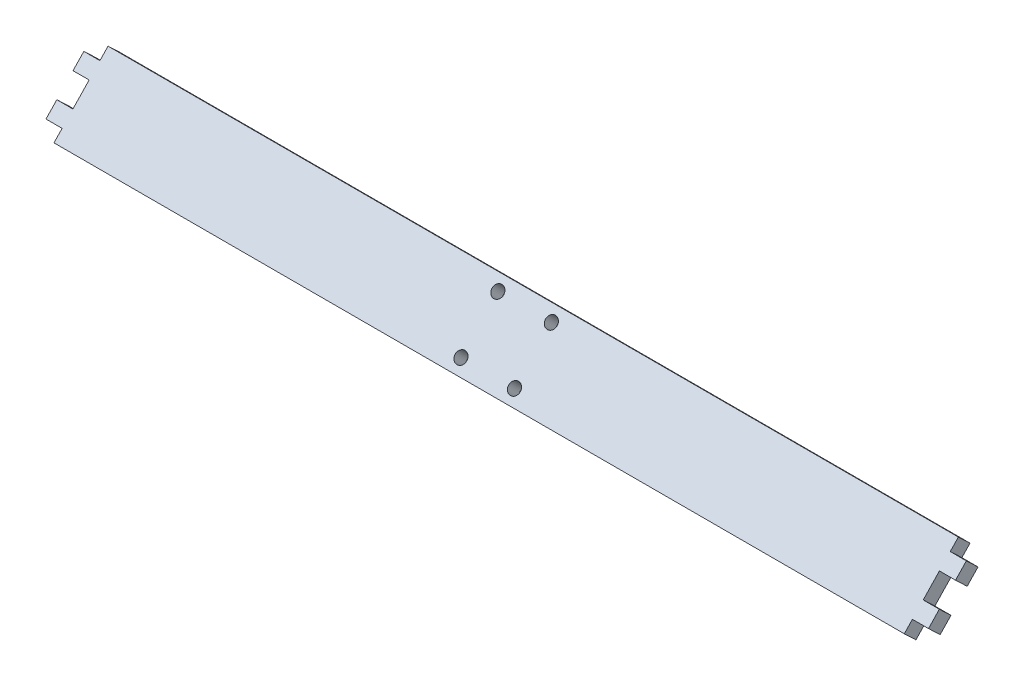
ISO-10303-21;
HEADER;
FILE_DESCRIPTION(('STEP AP214'),'2;1');
FILE_NAME('part.step','',(''),(''),'','','');
FILE_SCHEMA(('AUTOMOTIVE_DESIGN { 1 0 10303 214 1 1 1 1 }'));
ENDSEC;
DATA;
#1=APPLICATION_CONTEXT('core data for automotive mechanical design processes');
#2=APPLICATION_PROTOCOL_DEFINITION('international standard','automotive_design',2000,#1);
#3=PRODUCT_CONTEXT('',#1,'mechanical');
#4=PRODUCT('Part','Part','',(#3));
#5=PRODUCT_RELATED_PRODUCT_CATEGORY('part','',(#4));
#6=PRODUCT_DEFINITION_FORMATION('','',#4);
#7=PRODUCT_DEFINITION_CONTEXT('part definition',#1,'design');
#8=PRODUCT_DEFINITION('design','',#6,#7);
#9=PRODUCT_DEFINITION_SHAPE('','',#8);
#10=(LENGTH_UNIT() NAMED_UNIT(*) SI_UNIT(.MILLI.,.METRE.));
#11=(NAMED_UNIT(*) PLANE_ANGLE_UNIT() SI_UNIT($,.RADIAN.));
#12=(NAMED_UNIT(*) SI_UNIT($,.STERADIAN.) SOLID_ANGLE_UNIT());
#13=UNCERTAINTY_MEASURE_WITH_UNIT(LENGTH_MEASURE(1.E-05),#10,'distance_accuracy_value','');
#14=(GEOMETRIC_REPRESENTATION_CONTEXT(3) GLOBAL_UNCERTAINTY_ASSIGNED_CONTEXT((#13)) GLOBAL_UNIT_ASSIGNED_CONTEXT((#10,
#11,#12)) REPRESENTATION_CONTEXT('',''));
#15=CARTESIAN_POINT('',(0.,0.,0.));
#16=DIRECTION('',(0.,0.,1.));
#17=DIRECTION('',(1.,0.,0.));
#18=AXIS2_PLACEMENT_3D('',#15,#16,#17);
#19=CARTESIAN_POINT('',(-112.61,-13.8103448544922,-20.6734883306936));
#20=DIRECTION('',(-1.,0.,0.));
#21=DIRECTION('',(0.,0.,1.));
#22=AXIS2_PLACEMENT_3D('',#19,#20,#21);
#23=PLANE('',#22);
#24=DIRECTION('',(0.,0.689700373188127,0.724094879987532));
#25=VECTOR('',#24,1.);
#26=CARTESIAN_POINT('',(-112.61,-12.2477607566808,-37.8817447223245));
#27=LINE('',#26,#25);
#28=CARTESIAN_POINT('',(-112.61,-7.23177994845748,-32.615623138888));
#29=VERTEX_POINT('',#28);
#30=CARTESIAN_POINT('',(-112.61,-4.39711141465429,-29.6395931821392));
#31=VERTEX_POINT('',#30);
#32=EDGE_CURVE('E171',#29,#31,#27,.T.);
#33=ORIENTED_EDGE('',*,*,#32,.T.);
#34=DIRECTION('',(0.,0.724094879987532,-0.689700373188127));
#35=VECTOR('',#34,1.);
#36=CARTESIAN_POINT('',(-112.61,-13.8103448544922,-20.6734883306936));
#37=LINE('',#36,#35);
#38=CARTESIAN_POINT('',(-112.61,-1.50073189470416,-32.3983946748917));
#39=VERTEX_POINT('',#38);
#40=EDGE_CURVE('E220',#31,#39,#37,.T.);
#41=ORIENTED_EDGE('',*,*,#40,.T.);
#42=DIRECTION('',(0.,0.689700373188127,0.724094879987532));
#43=VECTOR('',#42,1.);
#44=CARTESIAN_POINT('',(-112.61,-9.35138123673063,-40.640546215077));
#45=LINE('',#44,#43);
#46=CARTESIAN_POINT('',(-112.61,-4.33540042850735,-35.3744246316405));
#47=VERTEX_POINT('',#46);
#48=EDGE_CURVE('E195',#47,#39,#45,.T.);
#49=ORIENTED_EDGE('',*,*,#48,.F.);
#50=DIRECTION('',(0.,0.724094879987532,-0.689700373188127));
#51=VECTOR('',#50,1.);
#52=CARTESIAN_POINT('',(-112.61,-16.6450133882954,-23.6495182874423));
#53=LINE('',#52,#51);
#54=EDGE_CURVE('E187',#29,#47,#53,.T.);
#55=ORIENTED_EDGE('',*,*,#54,.F.);
#56=EDGE_LOOP('',(#33,#41,#49,#55));
#57=FACE_BOUND('',#56,.T.);
#58=ADVANCED_FACE('F33',(#57),#23,.T.);
#59=CARTESIAN_POINT('',(112.61,-13.8103448544922,-20.6734883306936));
#60=DIRECTION('',(-1.,0.,0.));
#61=DIRECTION('',(0.,0.,1.));
#62=AXIS2_PLACEMENT_3D('',#59,#60,#61);
#63=PLANE('',#62);
#64=DIRECTION('',(0.,0.724094879987532,-0.689700373188127));
#65=VECTOR('',#64,1.);
#66=CARTESIAN_POINT('',(112.61,-13.8103448544922,-20.6734883306936));
#67=LINE('',#66,#65);
#68=CARTESIAN_POINT('',(112.61,-4.39711141465429,-29.6395931821392));
#69=VERTEX_POINT('',#68);
#70=CARTESIAN_POINT('',(112.61,-1.50073189470416,-32.3983946748917));
#71=VERTEX_POINT('',#70);
#72=EDGE_CURVE('E232',#69,#71,#67,.T.);
#73=ORIENTED_EDGE('',*,*,#72,.F.);
#74=DIRECTION('',(0.,0.689700373188127,0.724094879987532));
#75=VECTOR('',#74,1.);
#76=CARTESIAN_POINT('',(112.61,-12.2477607566808,-37.8817447223245));
#77=LINE('',#76,#75);
#78=CARTESIAN_POINT('',(112.61,-7.23177994845748,-32.615623138888));
#79=VERTEX_POINT('',#78);
#80=EDGE_CURVE('E262',#79,#69,#77,.T.);
#81=ORIENTED_EDGE('',*,*,#80,.F.);
#82=DIRECTION('',(0.,0.724094879987532,-0.689700373188127));
#83=VECTOR('',#82,1.);
#84=CARTESIAN_POINT('',(112.61,-16.6450133882954,-23.6495182874423));
#85=LINE('',#84,#83);
#86=CARTESIAN_POINT('',(112.61,-4.33540042850734,-35.3744246316405));
#87=VERTEX_POINT('',#86);
#88=EDGE_CURVE('E207',#79,#87,#85,.T.);
#89=ORIENTED_EDGE('',*,*,#88,.T.);
#90=DIRECTION('',(0.,0.689700373188127,0.724094879987532));
#91=VECTOR('',#90,1.);
#92=CARTESIAN_POINT('',(112.61,-9.35138123673063,-40.640546215077));
#93=LINE('',#92,#91);
#94=EDGE_CURVE('E273',#87,#71,#93,.T.);
#95=ORIENTED_EDGE('',*,*,#94,.T.);
#96=EDGE_LOOP('',(#73,#81,#89,#95));
#97=FACE_BOUND('',#96,.T.);
#98=ADVANCED_FACE('F341',(#97),#63,.F.);
#99=DIRECTION('',(0.,0.689700373188127,0.724094879987532));
#100=VECTOR('',#99,1.);
#101=CARTESIAN_POINT('',(-112.61,-16.592330036606,-33.7435424831957));
#102=LINE('',#101,#100);
#103=CARTESIAN_POINT('',(-112.61,-11.5763492283827,-28.4774208997592));
#104=VERTEX_POINT('',#103);
#105=CARTESIAN_POINT('',(-112.61,-8.74168069457949,-25.5013909430105));
#106=VERTEX_POINT('',#105);
#107=EDGE_CURVE('E181',#104,#106,#102,.T.);
#108=ORIENTED_EDGE('',*,*,#107,.F.);
#109=CARTESIAN_POINT('',(-112.61,-14.4727287483328,-25.7186194070067));
#110=VERTEX_POINT('',#109);
#111=EDGE_CURVE('E196',#110,#104,#53,.T.);
#112=ORIENTED_EDGE('',*,*,#111,.F.);
#113=DIRECTION('',(0.,0.689700373188127,0.724094879987532));
#114=VECTOR('',#113,1.);
#115=CARTESIAN_POINT('',(-112.61,-19.4887095565561,-30.9847409904432));
#116=LINE('',#115,#114);
#117=CARTESIAN_POINT('',(-112.61,-11.6380602145296,-22.742589450258));
#118=VERTEX_POINT('',#117);
#119=EDGE_CURVE('E367',#110,#118,#116,.T.);
#120=ORIENTED_EDGE('',*,*,#119,.T.);
#121=EDGE_CURVE('E225',#118,#106,#37,.T.);
#122=ORIENTED_EDGE('',*,*,#121,.T.);
#123=EDGE_LOOP('',(#108,#112,#120,#122));
#124=FACE_BOUND('',#123,.T.);
#125=ADVANCED_FACE('F35',(#124),#23,.T.);
#126=CARTESIAN_POINT('',(-112.61,-13.8103448544922,-20.6734883306936));
#127=DIRECTION('',(0.,0.724094879987532,-0.689700373188127));
#128=DIRECTION('',(0.,0.689700373188127,0.724094879987532));
#129=AXIS2_PLACEMENT_3D('',#126,#127,#128);
#130=PLANE('',#129);
#131=DIRECTION('',(1.,0.,0.));
#132=VECTOR('',#131,1.);
#133=CARTESIAN_POINT('',(-112.61,-13.8103448544922,-20.6734883306936));
#134=LINE('',#133,#132);
#135=CARTESIAN_POINT('',(-108.5,-13.8103448544922,-20.6734883306936));
#136=VERTEX_POINT('',#135);
#137=CARTESIAN_POINT('',(108.5,-13.8103448544922,-20.6734883306936));
#138=VERTEX_POINT('',#137);
#139=EDGE_CURVE('E11',#136,#138,#134,.T.);
#140=ORIENTED_EDGE('',*,*,#139,.F.);
#141=DIRECTION('',(0.,0.689700373188127,0.724094879987532));
#142=VECTOR('',#141,1.);
#143=CARTESIAN_POINT('',(-108.5,-21.6609941965187,-28.9156398708788));
#144=LINE('',#143,#142);
#145=CARTESIAN_POINT('',(-108.5,-16.6450133882954,-23.6495182874423));
#146=VERTEX_POINT('',#145);
#147=EDGE_CURVE('E370',#146,#136,#144,.T.);
#148=ORIENTED_EDGE('',*,*,#147,.F.);
#149=DIRECTION('',(1.,0.,0.));
#150=VECTOR('',#149,1.);
#151=CARTESIAN_POINT('',(-112.61,-16.6450133882954,-23.6495182874423));
#152=LINE('',#151,#150);
#153=CARTESIAN_POINT('',(108.5,-16.6450133882954,-23.6495182874423));
#154=VERTEX_POINT('',#153);
#155=EDGE_CURVE('E37',#146,#154,#152,.T.);
#156=ORIENTED_EDGE('',*,*,#155,.T.);
#157=DIRECTION('',(0.,0.689700373188127,0.724094879987532));
#158=VECTOR('',#157,1.);
#159=CARTESIAN_POINT('',(108.5,-21.6609941965187,-28.9156398708788));
#160=LINE('',#159,#158);
#161=EDGE_CURVE('E384',#154,#138,#160,.T.);
#162=ORIENTED_EDGE('',*,*,#161,.T.);
#163=EDGE_LOOP('',(#140,#148,#156,#162));
#164=FACE_BOUND('',#163,.T.);
#165=ADVANCED_FACE('F347',(#164),#130,.F.);
#166=CARTESIAN_POINT('',(112.61,-11.6380602145296,-22.742589450258));
#167=VERTEX_POINT('',#166);
#168=CARTESIAN_POINT('',(112.61,-8.74168069457949,-25.5013909430105));
#169=VERTEX_POINT('',#168);
#170=EDGE_CURVE('E42',#167,#169,#67,.T.);
#171=ORIENTED_EDGE('',*,*,#170,.F.);
#172=DIRECTION('',(0.,0.689700373188127,0.724094879987532));
#173=VECTOR('',#172,1.);
#174=CARTESIAN_POINT('',(112.61,-19.4887095565561,-30.9847409904432));
#175=LINE('',#174,#173);
#176=CARTESIAN_POINT('',(112.61,-14.4727287483328,-25.7186194070067));
#177=VERTEX_POINT('',#176);
#178=EDGE_CURVE('E250',#177,#167,#175,.T.);
#179=ORIENTED_EDGE('',*,*,#178,.F.);
#180=CARTESIAN_POINT('',(112.61,-11.5763492283827,-28.4774208997592));
#181=VERTEX_POINT('',#180);
#182=EDGE_CURVE('E209',#177,#181,#85,.T.);
#183=ORIENTED_EDGE('',*,*,#182,.T.);
#184=DIRECTION('',(0.,0.689700373188127,0.724094879987532));
#185=VECTOR('',#184,1.);
#186=CARTESIAN_POINT('',(112.61,-16.592330036606,-33.7435424831957));
#187=LINE('',#186,#185);
#188=EDGE_CURVE('E251',#181,#169,#187,.T.);
#189=ORIENTED_EDGE('',*,*,#188,.T.);
#190=EDGE_LOOP('',(#171,#179,#183,#189));
#191=FACE_BOUND('',#190,.T.);
#192=ADVANCED_FACE('F249',(#191),#63,.F.);
#193=CARTESIAN_POINT('',(-112.61,0.671552745258449,-34.4674957944561));
#194=DIRECTION('',(0.,0.724094879987532,-0.689700373188127));
#195=DIRECTION('',(0.,0.689700373188127,0.724094879987532));
#196=AXIS2_PLACEMENT_3D('',#193,#194,#195);
#197=PLANE('',#196);
#198=DIRECTION('',(0.,0.689700373188127,0.724094879987532));
#199=VECTOR('',#198,1.);
#200=CARTESIAN_POINT('',(108.5,-7.17909659676803,-42.7096473346414));
#201=LINE('',#200,#199);
#202=CARTESIAN_POINT('',(108.5,-2.16311578854475,-37.4435257512049));
#203=VERTEX_POINT('',#202);
#204=CARTESIAN_POINT('',(108.5,0.671552745258437,-34.4674957944561));
#205=VERTEX_POINT('',#204);
#206=EDGE_CURVE('E266',#203,#205,#201,.T.);
#207=ORIENTED_EDGE('',*,*,#206,.F.);
#208=DIRECTION('',(1.,0.,0.));
#209=VECTOR('',#208,1.);
#210=CARTESIAN_POINT('',(-112.61,-2.16311578854474,-37.4435257512049));
#211=LINE('',#210,#209);
#212=CARTESIAN_POINT('',(-108.5,-2.16311578854474,-37.4435257512049));
#213=VERTEX_POINT('',#212);
#214=EDGE_CURVE('E200',#213,#203,#211,.T.);
#215=ORIENTED_EDGE('',*,*,#214,.F.);
#216=DIRECTION('',(0.,0.689700373188127,0.724094879987532));
#217=VECTOR('',#216,1.);
#218=CARTESIAN_POINT('',(-108.5,-7.17909659676803,-42.7096473346414));
#219=LINE('',#218,#217);
#220=CARTESIAN_POINT('',(-108.5,0.671552745258437,-34.4674957944561));
#221=VERTEX_POINT('',#220);
#222=EDGE_CURVE('E289',#213,#221,#219,.T.);
#223=ORIENTED_EDGE('',*,*,#222,.T.);
#224=DIRECTION('',(1.,0.,0.));
#225=VECTOR('',#224,1.);
#226=CARTESIAN_POINT('',(-112.61,0.671552745258449,-34.4674957944561));
#227=LINE('',#226,#225);
#228=EDGE_CURVE('E228',#221,#205,#227,.T.);
#229=ORIENTED_EDGE('',*,*,#228,.T.);
#230=EDGE_LOOP('',(#207,#215,#223,#229));
#231=FACE_BOUND('',#230,.T.);
#232=ADVANCED_FACE('F328',(#231),#197,.T.);
#233=CARTESIAN_POINT('',(0.,-16.8939120366648,-17.7363905896742));
#234=DIRECTION('',(0.,-0.689700373188127,-0.724094879987532));
#235=DIRECTION('',(0.,0.724094879987532,-0.689700373188127));
#236=AXIS2_PLACEMENT_3D('',#233,#234,#235);
#237=PLANE('',#236);
#238=ORIENTED_EDGE('',*,*,#40,.F.);
#239=DIRECTION('',(-1.,0.,0.));
#240=VECTOR('',#239,1.);
#241=CARTESIAN_POINT('',(-108.5,-4.39711141465429,-29.6395931821392));
#242=LINE('',#241,#240);
#243=CARTESIAN_POINT('',(-108.5,-4.39711141465429,-29.6395931821392));
#244=VERTEX_POINT('',#243);
#245=EDGE_CURVE('E177',#244,#31,#242,.T.);
#246=ORIENTED_EDGE('',*,*,#245,.F.);
#247=DIRECTION('',(0.,0.724094879987532,-0.689700373188127));
#248=VECTOR('',#247,1.);
#249=CARTESIAN_POINT('',(-108.5,-8.74168069457949,-25.5013909430105));
#250=LINE('',#249,#248);
#251=CARTESIAN_POINT('',(-108.5,-8.74168069457949,-25.5013909430105));
#252=VERTEX_POINT('',#251);
#253=EDGE_CURVE('E379',#252,#244,#250,.T.);
#254=ORIENTED_EDGE('',*,*,#253,.F.);
#255=DIRECTION('',(1.,0.,0.));
#256=VECTOR('',#255,1.);
#257=CARTESIAN_POINT('',(-112.61,-8.74168069457949,-25.5013909430105));
#258=LINE('',#257,#256);
#259=EDGE_CURVE('E191',#106,#252,#258,.T.);
#260=ORIENTED_EDGE('',*,*,#259,.F.);
#261=ORIENTED_EDGE('',*,*,#121,.F.);
#262=DIRECTION('',(-1.,0.,0.));
#263=VECTOR('',#262,1.);
#264=CARTESIAN_POINT('',(-108.5,-11.6380602145296,-22.742589450258));
#265=LINE('',#264,#263);
#266=CARTESIAN_POINT('',(-108.5,-11.6380602145296,-22.742589450258));
#267=VERTEX_POINT('',#266);
#268=EDGE_CURVE('E368',#267,#118,#265,.T.);
#269=ORIENTED_EDGE('',*,*,#268,.F.);
#270=DIRECTION('',(0.,0.724094879987532,-0.689700373188127));
#271=VECTOR('',#270,1.);
#272=CARTESIAN_POINT('',(-108.5,-13.8103448544922,-20.6734883306936));
#273=LINE('',#272,#271);
#274=EDGE_CURVE('E372',#136,#267,#273,.T.);
#275=ORIENTED_EDGE('',*,*,#274,.F.);
#276=ORIENTED_EDGE('',*,*,#139,.T.);
#277=DIRECTION('',(0.,-0.724094879987532,0.689700373188127));
#278=VECTOR('',#277,1.);
#279=CARTESIAN_POINT('',(108.5,-13.8103448544922,-20.6734883306936));
#280=LINE('',#279,#278);
#281=CARTESIAN_POINT('',(108.5,-11.6380602145296,-22.742589450258));
#282=VERTEX_POINT('',#281);
#283=EDGE_CURVE('E256',#282,#138,#280,.T.);
#284=ORIENTED_EDGE('',*,*,#283,.F.);
#285=DIRECTION('',(-1.,0.,0.));
#286=VECTOR('',#285,1.);
#287=CARTESIAN_POINT('',(108.5,-11.6380602145296,-22.742589450258));
#288=LINE('',#287,#286);
#289=EDGE_CURVE('E248',#167,#282,#288,.T.);
#290=ORIENTED_EDGE('',*,*,#289,.F.);
#291=ORIENTED_EDGE('',*,*,#170,.T.);
#292=DIRECTION('',(1.,0.,0.));
#293=VECTOR('',#292,1.);
#294=CARTESIAN_POINT('',(112.61,-8.74168069457949,-25.5013909430105));
#295=LINE('',#294,#293);
#296=CARTESIAN_POINT('',(108.5,-8.74168069457949,-25.5013909430105));
#297=VERTEX_POINT('',#296);
#298=EDGE_CURVE('E245',#297,#169,#295,.T.);
#299=ORIENTED_EDGE('',*,*,#298,.F.);
#300=DIRECTION('',(0.,-0.724094879987532,0.689700373188127));
#301=VECTOR('',#300,1.);
#302=CARTESIAN_POINT('',(108.5,-8.74168069457949,-25.5013909430105));
#303=LINE('',#302,#301);
#304=CARTESIAN_POINT('',(108.5,-4.39711141465429,-29.6395931821392));
#305=VERTEX_POINT('',#304);
#306=EDGE_CURVE('E392',#305,#297,#303,.T.);
#307=ORIENTED_EDGE('',*,*,#306,.F.);
#308=DIRECTION('',(-1.,0.,0.));
#309=VECTOR('',#308,1.);
#310=CARTESIAN_POINT('',(108.5,-4.39711141465429,-29.6395931821392));
#311=LINE('',#310,#309);
#312=EDGE_CURVE('E395',#69,#305,#311,.T.);
#313=ORIENTED_EDGE('',*,*,#312,.F.);
#314=ORIENTED_EDGE('',*,*,#72,.T.);
#315=DIRECTION('',(1.,0.,0.));
#316=VECTOR('',#315,1.);
#317=CARTESIAN_POINT('',(112.61,-1.50073189470416,-32.3983946748917));
#318=LINE('',#317,#316);
#319=CARTESIAN_POINT('',(108.5,-1.50073189470416,-32.3983946748917));
#320=VERTEX_POINT('',#319);
#321=EDGE_CURVE('E264',#320,#71,#318,.T.);
#322=ORIENTED_EDGE('',*,*,#321,.F.);
#323=DIRECTION('',(0.,-0.724094879987532,0.689700373188127));
#324=VECTOR('',#323,1.);
#325=CARTESIAN_POINT('',(108.5,-1.50073189470416,-32.3983946748917));
#326=LINE('',#325,#324);
#327=EDGE_CURVE('E267',#205,#320,#326,.T.);
#328=ORIENTED_EDGE('',*,*,#327,.F.);
#329=ORIENTED_EDGE('',*,*,#228,.F.);
#330=DIRECTION('',(0.,0.724094879987532,-0.689700373188127));
#331=VECTOR('',#330,1.);
#332=CARTESIAN_POINT('',(-108.5,-1.50073189470416,-32.3983946748917));
#333=LINE('',#332,#331);
#334=CARTESIAN_POINT('',(-108.5,-1.50073189470416,-32.3983946748917));
#335=VERTEX_POINT('',#334);
#336=EDGE_CURVE('E281',#335,#221,#333,.T.);
#337=ORIENTED_EDGE('',*,*,#336,.F.);
#338=DIRECTION('',(1.,0.,0.));
#339=VECTOR('',#338,1.);
#340=CARTESIAN_POINT('',(-112.61,-1.50073189470416,-32.3983946748917));
#341=LINE('',#340,#339);
#342=EDGE_CURVE('E284',#39,#335,#341,.T.);
#343=ORIENTED_EDGE('',*,*,#342,.F.);
#344=EDGE_LOOP('',(#238,#246,#254,#260,#261,#269,#275,#276,#284,#290,#291,#299,#307,#313,#314,
#322,#328,#329,#337,#343));
#345=FACE_BOUND('',#344,.T.);
#346=CARTESIAN_POINT('',(6.82499999999999,-11.5113436105318,-22.8632870155659));
#347=DIRECTION('',(0.,0.689700373188127,0.724094879987532));
#348=DIRECTION('',(0.,-0.724094879987532,0.689700373188127));
#349=AXIS2_PLACEMENT_3D('',#346,#347,#348);
#350=CIRCLE('',#349,1.4859);
#351=CARTESIAN_POINT('',(6.82499999999999,-12.5872761927053,-21.8384612310457));
#352=VERTEX_POINT('',#351);
#353=EDGE_CURVE('E298',#352,#352,#350,.T.);
#354=ORIENTED_EDGE('',*,*,#353,.F.);
#355=EDGE_LOOP('',(#354));
#356=FACE_BOUND('',#355,.T.);
#357=CARTESIAN_POINT('',(6.82499999999999,-1.62744849870199,-32.2776971095838));
#358=DIRECTION('',(0.,0.689700373188127,0.724094879987532));
#359=DIRECTION('',(0.,-0.724094879987532,0.689700373188127));
#360=AXIS2_PLACEMENT_3D('',#357,#358,#359);
#361=CIRCLE('',#360,1.4859);
#362=CARTESIAN_POINT('',(6.82499999999999,-2.70338108087546,-31.2528713250636));
#363=VERTEX_POINT('',#362);
#364=EDGE_CURVE('E304',#363,#363,#361,.T.);
#365=ORIENTED_EDGE('',*,*,#364,.F.);
#366=EDGE_LOOP('',(#365));
#367=FACE_BOUND('',#366,.T.);
#368=CARTESIAN_POINT('',(-6.82499999999999,-1.62744849870198,-32.2776971095838));
#369=DIRECTION('',(0.,0.689700373188127,0.724094879987532));
#370=DIRECTION('',(0.,-0.724094879987532,0.689700373188127));
#371=AXIS2_PLACEMENT_3D('',#368,#369,#370);
#372=CIRCLE('',#371,1.4859);
#373=CARTESIAN_POINT('',(-6.82499999999999,-2.70338108087546,-31.2528713250636));
#374=VERTEX_POINT('',#373);
#375=EDGE_CURVE('E310',#374,#374,#372,.T.);
#376=ORIENTED_EDGE('',*,*,#375,.F.);
#377=EDGE_LOOP('',(#376));
#378=FACE_BOUND('',#377,.T.);
#379=CARTESIAN_POINT('',(-6.825,-11.5113436105318,-22.8632870155659));
#380=DIRECTION('',(0.,0.689700373188127,0.724094879987532));
#381=DIRECTION('',(0.,-0.724094879987532,0.689700373188127));
#382=AXIS2_PLACEMENT_3D('',#379,#380,#381);
#383=CIRCLE('',#382,1.4859);
#384=CARTESIAN_POINT('',(-6.825,-12.5872761927053,-21.8384612310457));
#385=VERTEX_POINT('',#384);
#386=EDGE_CURVE('E197',#385,#385,#383,.T.);
#387=ORIENTED_EDGE('',*,*,#386,.F.);
#388=EDGE_LOOP('',(#387));
#389=FACE_BOUND('',#388,.T.);
#390=ADVANCED_FACE('F242',(#345,#356,#367,#378,#389),#237,.F.);
#391=CARTESIAN_POINT('',(0.,-19.7285805704679,-20.712420546423));
#392=DIRECTION('',(0.,-0.689700373188127,-0.724094879987532));
#393=DIRECTION('',(0.,0.724094879987532,-0.689700373188127));
#394=AXIS2_PLACEMENT_3D('',#391,#392,#393);
#395=PLANE('',#394);
#396=DIRECTION('',(-1.,0.,0.));
#397=VECTOR('',#396,1.);
#398=CARTESIAN_POINT('',(-108.5,-7.23177994845747,-32.615623138888));
#399=LINE('',#398,#397);
#400=CARTESIAN_POINT('',(-108.5,-7.23177994845747,-32.615623138888));
#401=VERTEX_POINT('',#400);
#402=EDGE_CURVE('E174',#401,#29,#399,.T.);
#403=ORIENTED_EDGE('',*,*,#402,.T.);
#404=ORIENTED_EDGE('',*,*,#54,.T.);
#405=DIRECTION('',(1.,0.,0.));
#406=VECTOR('',#405,1.);
#407=CARTESIAN_POINT('',(-112.61,-4.33540042850734,-35.3744246316405));
#408=LINE('',#407,#406);
#409=CARTESIAN_POINT('',(-108.5,-4.33540042850734,-35.3744246316405));
#410=VERTEX_POINT('',#409);
#411=EDGE_CURVE('E290',#47,#410,#408,.T.);
#412=ORIENTED_EDGE('',*,*,#411,.T.);
#413=DIRECTION('',(0.,0.724094879987532,-0.689700373188127));
#414=VECTOR('',#413,1.);
#415=CARTESIAN_POINT('',(-108.5,-4.33540042850734,-35.3744246316405));
#416=LINE('',#415,#414);
#417=EDGE_CURVE('E283',#410,#213,#416,.T.);
#418=ORIENTED_EDGE('',*,*,#417,.T.);
#419=ORIENTED_EDGE('',*,*,#214,.T.);
#420=DIRECTION('',(0.,-0.724094879987532,0.689700373188127));
#421=VECTOR('',#420,1.);
#422=CARTESIAN_POINT('',(108.5,-4.33540042850734,-35.3744246316405));
#423=LINE('',#422,#421);
#424=CARTESIAN_POINT('',(108.5,-4.33540042850735,-35.3744246316405));
#425=VERTEX_POINT('',#424);
#426=EDGE_CURVE('E275',#203,#425,#423,.T.);
#427=ORIENTED_EDGE('',*,*,#426,.T.);
#428=DIRECTION('',(1.,0.,0.));
#429=VECTOR('',#428,1.);
#430=CARTESIAN_POINT('',(112.61,-4.33540042850734,-35.3744246316405));
#431=LINE('',#430,#429);
#432=EDGE_CURVE('E270',#425,#87,#431,.T.);
#433=ORIENTED_EDGE('',*,*,#432,.T.);
#434=ORIENTED_EDGE('',*,*,#88,.F.);
#435=DIRECTION('',(-1.,0.,0.));
#436=VECTOR('',#435,1.);
#437=CARTESIAN_POINT('',(108.5,-7.23177994845747,-32.615623138888));
#438=LINE('',#437,#436);
#439=CARTESIAN_POINT('',(108.5,-7.23177994845747,-32.615623138888));
#440=VERTEX_POINT('',#439);
#441=EDGE_CURVE('E403',#79,#440,#438,.T.);
#442=ORIENTED_EDGE('',*,*,#441,.T.);
#443=DIRECTION('',(0.,-0.724094879987532,0.689700373188127));
#444=VECTOR('',#443,1.);
#445=CARTESIAN_POINT('',(108.5,-11.5763492283827,-28.4774208997592));
#446=LINE('',#445,#444);
#447=CARTESIAN_POINT('',(108.5,-11.5763492283827,-28.4774208997592));
#448=VERTEX_POINT('',#447);
#449=EDGE_CURVE('E399',#440,#448,#446,.T.);
#450=ORIENTED_EDGE('',*,*,#449,.T.);
#451=DIRECTION('',(1.,0.,0.));
#452=VECTOR('',#451,1.);
#453=CARTESIAN_POINT('',(112.61,-11.5763492283827,-28.4774208997592));
#454=LINE('',#453,#452);
#455=EDGE_CURVE('E254',#448,#181,#454,.T.);
#456=ORIENTED_EDGE('',*,*,#455,.T.);
#457=ORIENTED_EDGE('',*,*,#182,.F.);
#458=DIRECTION('',(-1.,0.,0.));
#459=VECTOR('',#458,1.);
#460=CARTESIAN_POINT('',(108.5,-14.4727287483328,-25.7186194070067));
#461=LINE('',#460,#459);
#462=CARTESIAN_POINT('',(108.5,-14.4727287483328,-25.7186194070067));
#463=VERTEX_POINT('',#462);
#464=EDGE_CURVE('E386',#177,#463,#461,.T.);
#465=ORIENTED_EDGE('',*,*,#464,.T.);
#466=DIRECTION('',(0.,-0.724094879987532,0.689700373188127));
#467=VECTOR('',#466,1.);
#468=CARTESIAN_POINT('',(108.5,-16.6450133882954,-23.6495182874423));
#469=LINE('',#468,#467);
#470=EDGE_CURVE('E381',#463,#154,#469,.T.);
#471=ORIENTED_EDGE('',*,*,#470,.T.);
#472=ORIENTED_EDGE('',*,*,#155,.F.);
#473=DIRECTION('',(0.,0.724094879987532,-0.689700373188127));
#474=VECTOR('',#473,1.);
#475=CARTESIAN_POINT('',(-108.5,-16.6450133882954,-23.6495182874423));
#476=LINE('',#475,#474);
#477=CARTESIAN_POINT('',(-108.5,-14.4727287483328,-25.7186194070067));
#478=VERTEX_POINT('',#477);
#479=EDGE_CURVE('E365',#146,#478,#476,.T.);
#480=ORIENTED_EDGE('',*,*,#479,.T.);
#481=DIRECTION('',(-1.,0.,0.));
#482=VECTOR('',#481,1.);
#483=CARTESIAN_POINT('',(-108.5,-14.4727287483328,-25.7186194070067));
#484=LINE('',#483,#482);
#485=EDGE_CURVE('E364',#478,#110,#484,.T.);
#486=ORIENTED_EDGE('',*,*,#485,.T.);
#487=ORIENTED_EDGE('',*,*,#111,.T.);
#488=DIRECTION('',(1.,0.,0.));
#489=VECTOR('',#488,1.);
#490=CARTESIAN_POINT('',(-112.61,-11.5763492283827,-28.4774208997592));
#491=LINE('',#490,#489);
#492=CARTESIAN_POINT('',(-108.5,-11.5763492283827,-28.4774208997592));
#493=VERTEX_POINT('',#492);
#494=EDGE_CURVE('E360',#104,#493,#491,.T.);
#495=ORIENTED_EDGE('',*,*,#494,.T.);
#496=DIRECTION('',(0.,0.724094879987532,-0.689700373188127));
#497=VECTOR('',#496,1.);
#498=CARTESIAN_POINT('',(-108.5,-11.5763492283827,-28.4774208997592));
#499=LINE('',#498,#497);
#500=EDGE_CURVE('E190',#493,#401,#499,.T.);
#501=ORIENTED_EDGE('',*,*,#500,.T.);
#502=EDGE_LOOP('',(#403,#404,#412,#418,#419,#427,#433,#434,#442,#450,#456,#457,#465,#471,#472,
#480,#486,#487,#495,#501));
#503=FACE_BOUND('',#502,.T.);
#504=CARTESIAN_POINT('',(6.82499999999999,-14.346012144335,-25.8393169723146));
#505=DIRECTION('',(0.,-0.689700373188127,-0.724094879987532));
#506=DIRECTION('',(0.,0.724094879987532,-0.689700373188127));
#507=AXIS2_PLACEMENT_3D('',#504,#505,#506);
#508=CIRCLE('',#507,1.4859);
#509=CARTESIAN_POINT('',(6.82499999999999,-13.2700795621615,-26.8641427568349));
#510=VERTEX_POINT('',#509);
#511=EDGE_CURVE('E301',#510,#510,#508,.F.);
#512=ORIENTED_EDGE('',*,*,#511,.T.);
#513=EDGE_LOOP('',(#512));
#514=FACE_BOUND('',#513,.T.);
#515=CARTESIAN_POINT('',(6.82499999999999,-4.46211703250517,-35.2537270663326));
#516=DIRECTION('',(0.,-0.689700373188127,-0.724094879987532));
#517=DIRECTION('',(0.,0.724094879987532,-0.689700373188127));
#518=AXIS2_PLACEMENT_3D('',#515,#516,#517);
#519=CIRCLE('',#518,1.4859);
#520=CARTESIAN_POINT('',(6.82499999999999,-3.3861844503317,-36.2785528508528));
#521=VERTEX_POINT('',#520);
#522=EDGE_CURVE('E307',#521,#521,#519,.F.);
#523=ORIENTED_EDGE('',*,*,#522,.T.);
#524=EDGE_LOOP('',(#523));
#525=FACE_BOUND('',#524,.T.);
#526=CARTESIAN_POINT('',(-6.82499999999999,-4.46211703250517,-35.2537270663326));
#527=DIRECTION('',(0.,-0.689700373188127,-0.724094879987532));
#528=DIRECTION('',(0.,0.724094879987532,-0.689700373188127));
#529=AXIS2_PLACEMENT_3D('',#526,#527,#528);
#530=CIRCLE('',#529,1.4859);
#531=CARTESIAN_POINT('',(-6.82499999999999,-3.38618445033169,-36.2785528508528));
#532=VERTEX_POINT('',#531);
#533=EDGE_CURVE('E297',#532,#532,#530,.F.);
#534=ORIENTED_EDGE('',*,*,#533,.T.);
#535=EDGE_LOOP('',(#534));
#536=FACE_BOUND('',#535,.T.);
#537=CARTESIAN_POINT('',(-6.825,-14.346012144335,-25.8393169723146));
#538=DIRECTION('',(0.,-0.689700373188127,-0.724094879987532));
#539=DIRECTION('',(0.,0.724094879987532,-0.689700373188127));
#540=AXIS2_PLACEMENT_3D('',#537,#538,#539);
#541=CIRCLE('',#540,1.4859);
#542=CARTESIAN_POINT('',(-6.825,-13.2700795621615,-26.8641427568349));
#543=VERTEX_POINT('',#542);
#544=EDGE_CURVE('E202',#543,#543,#541,.F.);
#545=ORIENTED_EDGE('',*,*,#544,.T.);
#546=EDGE_LOOP('',(#545));
#547=FACE_BOUND('',#546,.T.);
#548=ADVANCED_FACE('F184',(#503,#514,#525,#536,#547),#395,.T.);
#549=CARTESIAN_POINT('',(-6.825,-21.2358319393855,-33.0727235812915));
#550=DIRECTION('',(0.,0.689700373188127,0.724094879987532));
#551=DIRECTION('',(0.,-0.724094879987532,0.689700373188127));
#552=AXIS2_PLACEMENT_3D('',#549,#550,#551);
#553=CYLINDRICAL_SURFACE('',#552,1.4859);
#554=ORIENTED_EDGE('',*,*,#544,.F.);
#555=EDGE_LOOP('',(#554));
#556=FACE_BOUND('',#555,.T.);
#557=ORIENTED_EDGE('',*,*,#386,.T.);
#558=EDGE_LOOP('',(#557));
#559=FACE_BOUND('',#558,.T.);
#560=ADVANCED_FACE('F322',(#556,#559),#553,.F.);
#561=CARTESIAN_POINT('',(-6.82499999999999,-11.3519368275557,-42.4871336753095));
#562=DIRECTION('',(0.,0.689700373188127,0.724094879987532));
#563=DIRECTION('',(0.,-0.724094879987532,0.689700373188127));
#564=AXIS2_PLACEMENT_3D('',#561,#562,#563);
#565=CYLINDRICAL_SURFACE('',#564,1.4859);
#566=ORIENTED_EDGE('',*,*,#533,.F.);
#567=EDGE_LOOP('',(#566));
#568=FACE_BOUND('',#567,.T.);
#569=ORIENTED_EDGE('',*,*,#375,.T.);
#570=EDGE_LOOP('',(#569));
#571=FACE_BOUND('',#570,.T.);
#572=ADVANCED_FACE('F318',(#568,#571),#565,.F.);
#573=CARTESIAN_POINT('',(6.82499999999999,-11.3519368275557,-42.4871336753095));
#574=DIRECTION('',(0.,0.689700373188127,0.724094879987532));
#575=DIRECTION('',(0.,-0.724094879987532,0.689700373188127));
#576=AXIS2_PLACEMENT_3D('',#573,#574,#575);
#577=CYLINDRICAL_SURFACE('',#576,1.4859);
#578=ORIENTED_EDGE('',*,*,#522,.F.);
#579=EDGE_LOOP('',(#578));
#580=FACE_BOUND('',#579,.T.);
#581=ORIENTED_EDGE('',*,*,#364,.T.);
#582=EDGE_LOOP('',(#581));
#583=FACE_BOUND('',#582,.T.);
#584=ADVANCED_FACE('F321',(#580,#583),#577,.F.);
#585=CARTESIAN_POINT('',(6.82499999999999,-21.2358319393855,-33.0727235812915));
#586=DIRECTION('',(0.,0.689700373188127,0.724094879987532));
#587=DIRECTION('',(0.,-0.724094879987532,0.689700373188127));
#588=AXIS2_PLACEMENT_3D('',#585,#586,#587);
#589=CYLINDRICAL_SURFACE('',#588,1.4859);
#590=ORIENTED_EDGE('',*,*,#511,.F.);
#591=EDGE_LOOP('',(#590));
#592=FACE_BOUND('',#591,.T.);
#593=ORIENTED_EDGE('',*,*,#353,.T.);
#594=EDGE_LOOP('',(#593));
#595=FACE_BOUND('',#594,.T.);
#596=ADVANCED_FACE('F436',(#592,#595),#589,.F.);
#597=CARTESIAN_POINT('',(-108.5,-9.35138123673063,-40.640546215077));
#598=DIRECTION('',(1.,0.,0.));
#599=DIRECTION('',(0.,0.,-1.));
#600=AXIS2_PLACEMENT_3D('',#597,#598,#599);
#601=PLANE('',#600);
#602=DIRECTION('',(0.,0.689700373188127,0.724094879987532));
#603=VECTOR('',#602,1.);
#604=CARTESIAN_POINT('',(-108.5,-9.35138123673063,-40.640546215077));
#605=LINE('',#604,#603);
#606=EDGE_CURVE('E292',#410,#335,#605,.T.);
#607=ORIENTED_EDGE('',*,*,#606,.T.);
#608=ORIENTED_EDGE('',*,*,#336,.T.);
#609=ORIENTED_EDGE('',*,*,#222,.F.);
#610=ORIENTED_EDGE('',*,*,#417,.F.);
#611=EDGE_LOOP('',(#607,#608,#609,#610));
#612=FACE_BOUND('',#611,.T.);
#613=ADVANCED_FACE('F425',(#612),#601,.F.);
#614=CARTESIAN_POINT('',(-112.61,-9.35138123673063,-40.640546215077));
#615=DIRECTION('',(0.,-0.724094879987532,0.689700373188127));
#616=DIRECTION('',(0.,-0.689700373188127,-0.724094879987532));
#617=AXIS2_PLACEMENT_3D('',#614,#615,#616);
#618=PLANE('',#617);
#619=ORIENTED_EDGE('',*,*,#48,.T.);
#620=ORIENTED_EDGE('',*,*,#342,.T.);
#621=ORIENTED_EDGE('',*,*,#606,.F.);
#622=ORIENTED_EDGE('',*,*,#411,.F.);
#623=EDGE_LOOP('',(#619,#620,#621,#622));
#624=FACE_BOUND('',#623,.T.);
#625=ADVANCED_FACE('F428',(#624),#618,.F.);
#626=CARTESIAN_POINT('',(108.5,-9.35138123673063,-40.640546215077));
#627=DIRECTION('',(-1.,0.,0.));
#628=DIRECTION('',(0.,0.,1.));
#629=AXIS2_PLACEMENT_3D('',#626,#627,#628);
#630=PLANE('',#629);
#631=ORIENTED_EDGE('',*,*,#206,.T.);
#632=ORIENTED_EDGE('',*,*,#327,.T.);
#633=DIRECTION('',(0.,0.689700373188127,0.724094879987532));
#634=VECTOR('',#633,1.);
#635=CARTESIAN_POINT('',(108.5,-9.35138123673063,-40.640546215077));
#636=LINE('',#635,#634);
#637=EDGE_CURVE('E274',#425,#320,#636,.T.);
#638=ORIENTED_EDGE('',*,*,#637,.F.);
#639=ORIENTED_EDGE('',*,*,#426,.F.);
#640=EDGE_LOOP('',(#631,#632,#638,#639));
#641=FACE_BOUND('',#640,.T.);
#642=ADVANCED_FACE('F418',(#641),#630,.F.);
#643=CARTESIAN_POINT('',(112.61,-9.35138123673063,-40.640546215077));
#644=DIRECTION('',(0.,-0.724094879987532,0.689700373188127));
#645=DIRECTION('',(0.,-0.689700373188127,-0.724094879987532));
#646=AXIS2_PLACEMENT_3D('',#643,#644,#645);
#647=PLANE('',#646);
#648=ORIENTED_EDGE('',*,*,#637,.T.);
#649=ORIENTED_EDGE('',*,*,#321,.T.);
#650=ORIENTED_EDGE('',*,*,#94,.F.);
#651=ORIENTED_EDGE('',*,*,#432,.F.);
#652=EDGE_LOOP('',(#648,#649,#650,#651));
#653=FACE_BOUND('',#652,.T.);
#654=ADVANCED_FACE('F413',(#653),#647,.F.);
#655=CARTESIAN_POINT('',(108.5,-12.2477607566808,-37.8817447223245));
#656=DIRECTION('',(0.,0.724094879987532,-0.689700373188127));
#657=DIRECTION('',(0.,0.689700373188127,0.724094879987532));
#658=AXIS2_PLACEMENT_3D('',#655,#656,#657);
#659=PLANE('',#658);
#660=ORIENTED_EDGE('',*,*,#80,.T.);
#661=ORIENTED_EDGE('',*,*,#312,.T.);
#662=DIRECTION('',(0.,0.689700373188127,0.724094879987532));
#663=VECTOR('',#662,1.);
#664=CARTESIAN_POINT('',(108.5,-12.2477607566808,-37.8817447223245));
#665=LINE('',#664,#663);
#666=EDGE_CURVE('E402',#440,#305,#665,.T.);
#667=ORIENTED_EDGE('',*,*,#666,.F.);
#668=ORIENTED_EDGE('',*,*,#441,.F.);
#669=EDGE_LOOP('',(#660,#661,#667,#668));
#670=FACE_BOUND('',#669,.T.);
#671=ADVANCED_FACE('F411',(#670),#659,.F.);
#672=CARTESIAN_POINT('',(108.5,-16.592330036606,-33.7435424831957));
#673=DIRECTION('',(-1.,0.,0.));
#674=DIRECTION('',(0.,0.,1.));
#675=AXIS2_PLACEMENT_3D('',#672,#673,#674);
#676=PLANE('',#675);
#677=ORIENTED_EDGE('',*,*,#666,.T.);
#678=ORIENTED_EDGE('',*,*,#306,.T.);
#679=DIRECTION('',(0.,0.689700373188127,0.724094879987532));
#680=VECTOR('',#679,1.);
#681=CARTESIAN_POINT('',(108.5,-16.592330036606,-33.7435424831957));
#682=LINE('',#681,#680);
#683=EDGE_CURVE('E258',#448,#297,#682,.T.);
#684=ORIENTED_EDGE('',*,*,#683,.F.);
#685=ORIENTED_EDGE('',*,*,#449,.F.);
#686=EDGE_LOOP('',(#677,#678,#684,#685));
#687=FACE_BOUND('',#686,.T.);
#688=ADVANCED_FACE('F408',(#687),#676,.F.);
#689=CARTESIAN_POINT('',(112.61,-16.592330036606,-33.7435424831957));
#690=DIRECTION('',(0.,-0.724094879987532,0.689700373188127));
#691=DIRECTION('',(0.,-0.689700373188127,-0.724094879987532));
#692=AXIS2_PLACEMENT_3D('',#689,#690,#691);
#693=PLANE('',#692);
#694=ORIENTED_EDGE('',*,*,#683,.T.);
#695=ORIENTED_EDGE('',*,*,#298,.T.);
#696=ORIENTED_EDGE('',*,*,#188,.F.);
#697=ORIENTED_EDGE('',*,*,#455,.F.);
#698=EDGE_LOOP('',(#694,#695,#696,#697));
#699=FACE_BOUND('',#698,.T.);
#700=ADVANCED_FACE('F501',(#699),#693,.F.);
#701=CARTESIAN_POINT('',(108.5,-19.4887095565561,-30.9847409904432));
#702=DIRECTION('',(0.,0.724094879987532,-0.689700373188127));
#703=DIRECTION('',(0.,0.689700373188127,0.724094879987532));
#704=AXIS2_PLACEMENT_3D('',#701,#702,#703);
#705=PLANE('',#704);
#706=ORIENTED_EDGE('',*,*,#178,.T.);
#707=ORIENTED_EDGE('',*,*,#289,.T.);
#708=DIRECTION('',(0.,0.689700373188127,0.724094879987532));
#709=VECTOR('',#708,1.);
#710=CARTESIAN_POINT('',(108.5,-19.4887095565561,-30.9847409904432));
#711=LINE('',#710,#709);
#712=EDGE_CURVE('E385',#463,#282,#711,.T.);
#713=ORIENTED_EDGE('',*,*,#712,.F.);
#714=ORIENTED_EDGE('',*,*,#464,.F.);
#715=EDGE_LOOP('',(#706,#707,#713,#714));
#716=FACE_BOUND('',#715,.T.);
#717=ADVANCED_FACE('F510',(#716),#705,.F.);
#718=CARTESIAN_POINT('',(108.5,-21.6609941965187,-28.9156398708788));
#719=DIRECTION('',(-1.,0.,0.));
#720=DIRECTION('',(0.,0.,1.));
#721=AXIS2_PLACEMENT_3D('',#718,#719,#720);
#722=PLANE('',#721);
#723=ORIENTED_EDGE('',*,*,#712,.T.);
#724=ORIENTED_EDGE('',*,*,#283,.T.);
#725=ORIENTED_EDGE('',*,*,#161,.F.);
#726=ORIENTED_EDGE('',*,*,#470,.F.);
#727=EDGE_LOOP('',(#723,#724,#725,#726));
#728=FACE_BOUND('',#727,.T.);
#729=ADVANCED_FACE('F519',(#728),#722,.F.);
#730=CARTESIAN_POINT('',(-108.5,-19.4887095565561,-30.9847409904432));
#731=DIRECTION('',(0.,0.724094879987532,-0.689700373188127));
#732=DIRECTION('',(0.,0.689700373188127,0.724094879987532));
#733=AXIS2_PLACEMENT_3D('',#730,#731,#732);
#734=PLANE('',#733);
#735=DIRECTION('',(0.,0.689700373188127,0.724094879987532));
#736=VECTOR('',#735,1.);
#737=CARTESIAN_POINT('',(-108.5,-19.4887095565561,-30.9847409904432));
#738=LINE('',#737,#736);
#739=EDGE_CURVE('E58',#478,#267,#738,.T.);
#740=ORIENTED_EDGE('',*,*,#739,.T.);
#741=ORIENTED_EDGE('',*,*,#268,.T.);
#742=ORIENTED_EDGE('',*,*,#119,.F.);
#743=ORIENTED_EDGE('',*,*,#485,.F.);
#744=EDGE_LOOP('',(#740,#741,#742,#743));
#745=FACE_BOUND('',#744,.T.);
#746=ADVANCED_FACE('F529',(#745),#734,.F.);
#747=CARTESIAN_POINT('',(-108.5,-21.6609941965187,-28.9156398708788));
#748=DIRECTION('',(1.,0.,0.));
#749=DIRECTION('',(0.,0.,-1.));
#750=AXIS2_PLACEMENT_3D('',#747,#748,#749);
#751=PLANE('',#750);
#752=ORIENTED_EDGE('',*,*,#147,.T.);
#753=ORIENTED_EDGE('',*,*,#274,.T.);
#754=ORIENTED_EDGE('',*,*,#739,.F.);
#755=ORIENTED_EDGE('',*,*,#479,.F.);
#756=EDGE_LOOP('',(#752,#753,#754,#755));
#757=FACE_BOUND('',#756,.T.);
#758=ADVANCED_FACE('F539',(#757),#751,.F.);
#759=CARTESIAN_POINT('',(-108.5,-12.2477607566808,-37.8817447223245));
#760=DIRECTION('',(0.,0.724094879987532,-0.689700373188127));
#761=DIRECTION('',(0.,0.689700373188127,0.724094879987532));
#762=AXIS2_PLACEMENT_3D('',#759,#760,#761);
#763=PLANE('',#762);
#764=DIRECTION('',(0.,0.689700373188127,0.724094879987532));
#765=VECTOR('',#764,1.);
#766=CARTESIAN_POINT('',(-108.5,-12.2477607566808,-37.8817447223245));
#767=LINE('',#766,#765);
#768=EDGE_CURVE('E50',#401,#244,#767,.T.);
#769=ORIENTED_EDGE('',*,*,#768,.T.);
#770=ORIENTED_EDGE('',*,*,#245,.T.);
#771=ORIENTED_EDGE('',*,*,#32,.F.);
#772=ORIENTED_EDGE('',*,*,#402,.F.);
#773=EDGE_LOOP('',(#769,#770,#771,#772));
#774=FACE_BOUND('',#773,.T.);
#775=ADVANCED_FACE('F173',(#774),#763,.F.);
#776=CARTESIAN_POINT('',(-112.61,-16.592330036606,-33.7435424831957));
#777=DIRECTION('',(0.,-0.724094879987532,0.689700373188127));
#778=DIRECTION('',(0.,-0.689700373188127,-0.724094879987532));
#779=AXIS2_PLACEMENT_3D('',#776,#777,#778);
#780=PLANE('',#779);
#781=ORIENTED_EDGE('',*,*,#107,.T.);
#782=ORIENTED_EDGE('',*,*,#259,.T.);
#783=DIRECTION('',(0.,0.689700373188127,0.724094879987532));
#784=VECTOR('',#783,1.);
#785=CARTESIAN_POINT('',(-108.5,-16.592330036606,-33.7435424831957));
#786=LINE('',#785,#784);
#787=EDGE_CURVE('E578',#493,#252,#786,.T.);
#788=ORIENTED_EDGE('',*,*,#787,.F.);
#789=ORIENTED_EDGE('',*,*,#494,.F.);
#790=EDGE_LOOP('',(#781,#782,#788,#789));
#791=FACE_BOUND('',#790,.T.);
#792=ADVANCED_FACE('F556',(#791),#780,.F.);
#793=CARTESIAN_POINT('',(-108.5,-16.592330036606,-33.7435424831957));
#794=DIRECTION('',(1.,0.,0.));
#795=DIRECTION('',(0.,0.,-1.));
#796=AXIS2_PLACEMENT_3D('',#793,#794,#795);
#797=PLANE('',#796);
#798=ORIENTED_EDGE('',*,*,#787,.T.);
#799=ORIENTED_EDGE('',*,*,#253,.T.);
#800=ORIENTED_EDGE('',*,*,#768,.F.);
#801=ORIENTED_EDGE('',*,*,#500,.F.);
#802=EDGE_LOOP('',(#798,#799,#800,#801));
#803=FACE_BOUND('',#802,.T.);
#804=ADVANCED_FACE('F565',(#803),#797,.F.);
#805=CLOSED_SHELL('',(#58,#98,#125,#165,#192,#232,#390,#548,#560,#572,#584,#596,#613,#625,#642,
#654,#671,#688,#700,#717,#729,#746,#758,#775,#792,#804));
#806=MANIFOLD_SOLID_BREP('B2',#805);
#807=ADVANCED_BREP_SHAPE_REPRESENTATION('',(#18,#806),#14);
#808=SHAPE_DEFINITION_REPRESENTATION(#9,#807);
ENDSEC;
END-ISO-10303-21;
